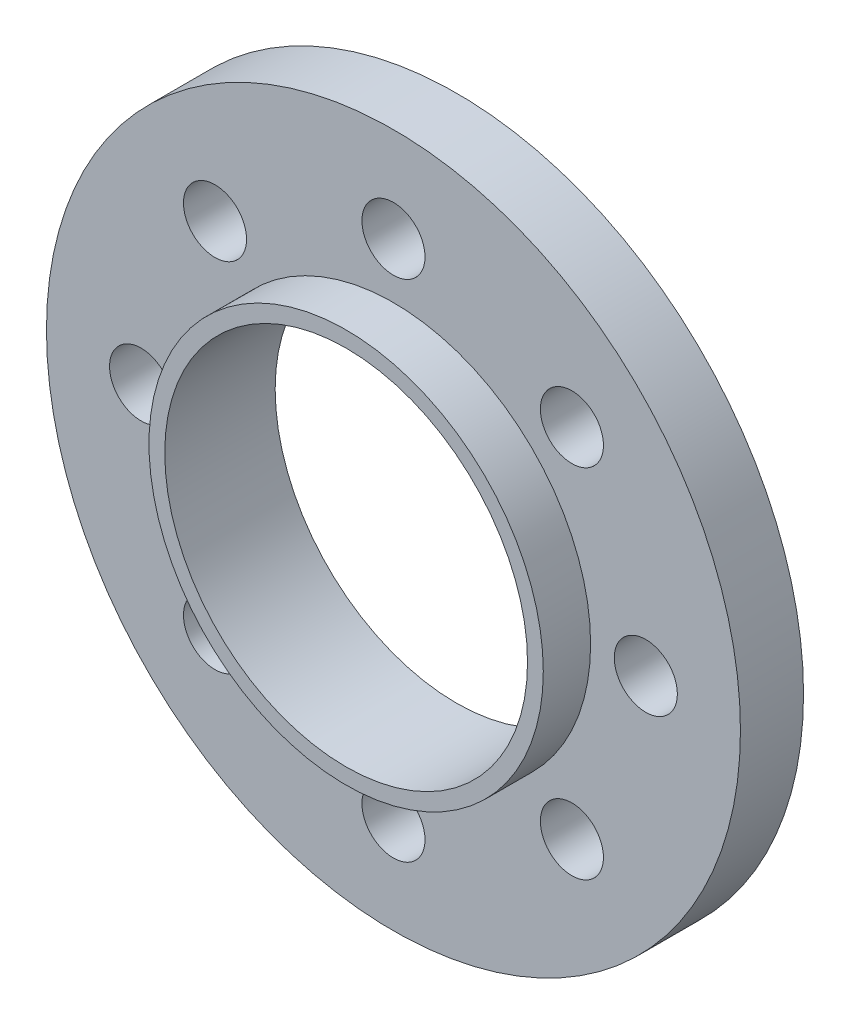
ISO-10303-21;
HEADER;
FILE_DESCRIPTION(('STEP AP214'),'2;1');
FILE_NAME('part.step','',(''),(''),'','','');
FILE_SCHEMA(('AUTOMOTIVE_DESIGN { 1 0 10303 214 1 1 1 1 }'));
ENDSEC;
DATA;
#1=APPLICATION_CONTEXT('core data for automotive mechanical design processes');
#2=APPLICATION_PROTOCOL_DEFINITION('international standard','automotive_design',2000,#1);
#3=PRODUCT_CONTEXT('',#1,'mechanical');
#4=PRODUCT('Part','Part','',(#3));
#5=PRODUCT_RELATED_PRODUCT_CATEGORY('part','',(#4));
#6=PRODUCT_DEFINITION_FORMATION('','',#4);
#7=PRODUCT_DEFINITION_CONTEXT('part definition',#1,'design');
#8=PRODUCT_DEFINITION('design','',#6,#7);
#9=PRODUCT_DEFINITION_SHAPE('','',#8);
#10=(LENGTH_UNIT() NAMED_UNIT(*) SI_UNIT(.MILLI.,.METRE.));
#11=(NAMED_UNIT(*) PLANE_ANGLE_UNIT() SI_UNIT($,.RADIAN.));
#12=(NAMED_UNIT(*) SI_UNIT($,.STERADIAN.) SOLID_ANGLE_UNIT());
#13=UNCERTAINTY_MEASURE_WITH_UNIT(LENGTH_MEASURE(1.E-05),#10,'distance_accuracy_value','');
#14=(GEOMETRIC_REPRESENTATION_CONTEXT(3) GLOBAL_UNCERTAINTY_ASSIGNED_CONTEXT((#13)) GLOBAL_UNIT_ASSIGNED_CONTEXT((#10,
#11,#12)) REPRESENTATION_CONTEXT('',''));
#15=CARTESIAN_POINT('',(0.,0.,0.));
#16=DIRECTION('',(0.,0.,1.));
#17=DIRECTION('',(1.,0.,0.));
#18=AXIS2_PLACEMENT_3D('',#15,#16,#17);
#19=CARTESIAN_POINT('',(0.,0.,2.));
#20=DIRECTION('',(0.,0.,1.));
#21=DIRECTION('',(1.,0.,0.));
#22=AXIS2_PLACEMENT_3D('',#19,#20,#21);
#23=PLANE('',#22);
#24=CARTESIAN_POINT('',(0.,0.,2.));
#25=DIRECTION('',(0.,0.,1.));
#26=DIRECTION('',(1.,0.,0.));
#27=AXIS2_PLACEMENT_3D('',#24,#25,#26);
#28=CIRCLE('',#27,6.25);
#29=CARTESIAN_POINT('',(6.25,0.,2.));
#30=VERTEX_POINT('',#29);
#31=EDGE_CURVE('E92',#30,#30,#28,.T.);
#32=ORIENTED_EDGE('',*,*,#31,.F.);
#33=EDGE_LOOP('',(#32));
#34=FACE_BOUND('',#33,.T.);
#35=CARTESIAN_POINT('',(-7.99999999999932,-6.81631167610037E-13,2.));
#36=DIRECTION('',(0.,0.,1.));
#37=DIRECTION('',(1.,0.,0.));
#38=AXIS2_PLACEMENT_3D('',#35,#36,#37);
#39=CIRCLE('',#38,1.00000000000093);
#40=CARTESIAN_POINT('',(-6.99999999999839,-6.81631167610037E-13,2.));
#41=VERTEX_POINT('',#40);
#42=EDGE_CURVE('E77',#41,#41,#39,.T.);
#43=ORIENTED_EDGE('',*,*,#42,.F.);
#44=EDGE_LOOP('',(#43));
#45=FACE_BOUND('',#44,.T.);
#46=CARTESIAN_POINT('',(1.36130290034144E-12,-8.,2.));
#47=DIRECTION('',(0.,0.,1.));
#48=DIRECTION('',(1.,0.,0.));
#49=AXIS2_PLACEMENT_3D('',#46,#47,#48);
#50=CIRCLE('',#49,1.00000000000136);
#51=CARTESIAN_POINT('',(1.00000000000272,-8.,2.));
#52=VERTEX_POINT('',#51);
#53=EDGE_CURVE('E65',#52,#52,#50,.T.);
#54=ORIENTED_EDGE('',*,*,#53,.F.);
#55=EDGE_LOOP('',(#54));
#56=FACE_BOUND('',#55,.T.);
#57=CARTESIAN_POINT('',(8.00000000000068,6.80651450170719E-13,2.));
#58=DIRECTION('',(0.,0.,1.));
#59=DIRECTION('',(1.,0.,0.));
#60=AXIS2_PLACEMENT_3D('',#57,#58,#59);
#61=CIRCLE('',#60,1.00000000000048);
#62=CARTESIAN_POINT('',(9.00000000000116,6.80651450170719E-13,2.));
#63=VERTEX_POINT('',#62);
#64=EDGE_CURVE('E53',#63,#63,#61,.T.);
#65=ORIENTED_EDGE('',*,*,#64,.F.);
#66=EDGE_LOOP('',(#65));
#67=FACE_BOUND('',#66,.T.);
#68=CARTESIAN_POINT('',(0.,8.,2.));
#69=DIRECTION('',(0.,0.,1.));
#70=DIRECTION('',(1.,0.,0.));
#71=AXIS2_PLACEMENT_3D('',#68,#69,#70);
#72=CIRCLE('',#71,1.);
#73=CARTESIAN_POINT('',(1.,8.,2.));
#74=VERTEX_POINT('',#73);
#75=EDGE_CURVE('E42',#74,#74,#72,.T.);
#76=ORIENTED_EDGE('',*,*,#75,.F.);
#77=EDGE_LOOP('',(#76));
#78=FACE_BOUND('',#77,.T.);
#79=CARTESIAN_POINT('',(0.,0.,2.));
#80=DIRECTION('',(0.,0.,1.));
#81=DIRECTION('',(1.,0.,0.));
#82=AXIS2_PLACEMENT_3D('',#79,#80,#81);
#83=CIRCLE('',#82,11.);
#84=CARTESIAN_POINT('',(11.,0.,2.));
#85=VERTEX_POINT('',#84);
#86=EDGE_CURVE('E10',#85,#85,#83,.T.);
#87=ORIENTED_EDGE('',*,*,#86,.T.);
#88=EDGE_LOOP('',(#87));
#89=FACE_BOUND('',#88,.T.);
#90=CARTESIAN_POINT('',(5.65685424949258,5.65685424949286,2.));
#91=DIRECTION('',(0.,0.,1.));
#92=DIRECTION('',(1.,0.,0.));
#93=AXIS2_PLACEMENT_3D('',#90,#91,#92);
#94=CIRCLE('',#93,1.00000000000006);
#95=CARTESIAN_POINT('',(6.65685424949264,5.65685424949286,2.));
#96=VERTEX_POINT('',#95);
#97=EDGE_CURVE('E47',#96,#96,#94,.T.);
#98=ORIENTED_EDGE('',*,*,#97,.F.);
#99=EDGE_LOOP('',(#98));
#100=FACE_BOUND('',#99,.T.);
#101=CARTESIAN_POINT('',(5.65685424949354,-5.6568542494919,2.));
#102=DIRECTION('',(0.,0.,1.));
#103=DIRECTION('',(1.,0.,0.));
#104=AXIS2_PLACEMENT_3D('',#101,#102,#103);
#105=CIRCLE('',#104,1.00000000000101);
#106=CARTESIAN_POINT('',(6.65685424949455,-5.6568542494919,2.));
#107=VERTEX_POINT('',#106);
#108=EDGE_CURVE('E59',#107,#107,#105,.T.);
#109=ORIENTED_EDGE('',*,*,#108,.F.);
#110=EDGE_LOOP('',(#109));
#111=FACE_BOUND('',#110,.T.);
#112=CARTESIAN_POINT('',(-5.65685424949122,-5.65685424949286,2.));
#113=DIRECTION('',(0.,0.,1.));
#114=DIRECTION('',(1.,0.,0.));
#115=AXIS2_PLACEMENT_3D('',#112,#113,#114);
#116=CIRCLE('',#115,1.00000000000132);
#117=CARTESIAN_POINT('',(-4.6568542494899,-5.65685424949286,2.));
#118=VERTEX_POINT('',#117);
#119=EDGE_CURVE('E71',#118,#118,#116,.T.);
#120=ORIENTED_EDGE('',*,*,#119,.F.);
#121=EDGE_LOOP('',(#120));
#122=FACE_BOUND('',#121,.T.);
#123=CARTESIAN_POINT('',(-5.65685424949218,5.6568542494919,2.));
#124=DIRECTION('',(0.,0.,1.));
#125=DIRECTION('',(1.,0.,0.));
#126=AXIS2_PLACEMENT_3D('',#123,#124,#125);
#127=CIRCLE('',#126,1.00000000000043);
#128=CARTESIAN_POINT('',(-4.65685424949176,5.6568542494919,2.));
#129=VERTEX_POINT('',#128);
#130=EDGE_CURVE('E83',#129,#129,#127,.T.);
#131=ORIENTED_EDGE('',*,*,#130,.F.);
#132=EDGE_LOOP('',(#131));
#133=FACE_BOUND('',#132,.T.);
#134=ADVANCED_FACE('F31',(#34,#45,#56,#67,#78,#89,#100,#111,#122,#133),#23,.T.);
#135=CARTESIAN_POINT('',(0.,0.,0.));
#136=DIRECTION('',(0.,0.,1.));
#137=DIRECTION('',(1.,0.,0.));
#138=AXIS2_PLACEMENT_3D('',#135,#136,#137);
#139=PLANE('',#138);
#140=CARTESIAN_POINT('',(0.,0.,0.));
#141=DIRECTION('',(0.,0.,1.));
#142=DIRECTION('',(1.,0.,0.));
#143=AXIS2_PLACEMENT_3D('',#140,#141,#142);
#144=CIRCLE('',#143,5.75);
#145=CARTESIAN_POINT('',(5.75,0.,0.));
#146=VERTEX_POINT('',#145);
#147=EDGE_CURVE('E95',#146,#146,#144,.T.);
#148=ORIENTED_EDGE('',*,*,#147,.T.);
#149=EDGE_LOOP('',(#148));
#150=FACE_BOUND('',#149,.T.);
#151=CARTESIAN_POINT('',(0.,0.,0.));
#152=DIRECTION('',(0.,0.,1.));
#153=DIRECTION('',(1.,0.,0.));
#154=AXIS2_PLACEMENT_3D('',#151,#152,#153);
#155=CIRCLE('',#154,11.);
#156=CARTESIAN_POINT('',(11.,0.,0.));
#157=VERTEX_POINT('',#156);
#158=EDGE_CURVE('E35',#157,#157,#155,.T.);
#159=ORIENTED_EDGE('',*,*,#158,.F.);
#160=EDGE_LOOP('',(#159));
#161=FACE_BOUND('',#160,.T.);
#162=CARTESIAN_POINT('',(0.,8.,0.));
#163=DIRECTION('',(0.,0.,1.));
#164=DIRECTION('',(1.,0.,0.));
#165=AXIS2_PLACEMENT_3D('',#162,#163,#164);
#166=CIRCLE('',#165,1.);
#167=CARTESIAN_POINT('',(1.,8.,0.));
#168=VERTEX_POINT('',#167);
#169=EDGE_CURVE('E44',#168,#168,#166,.T.);
#170=ORIENTED_EDGE('',*,*,#169,.T.);
#171=EDGE_LOOP('',(#170));
#172=FACE_BOUND('',#171,.T.);
#173=CARTESIAN_POINT('',(5.65685424949258,5.65685424949286,0.));
#174=DIRECTION('',(0.,0.,1.));
#175=DIRECTION('',(1.,0.,0.));
#176=AXIS2_PLACEMENT_3D('',#173,#174,#175);
#177=CIRCLE('',#176,1.00000000000006);
#178=CARTESIAN_POINT('',(6.65685424949264,5.65685424949286,0.));
#179=VERTEX_POINT('',#178);
#180=EDGE_CURVE('E50',#179,#179,#177,.T.);
#181=ORIENTED_EDGE('',*,*,#180,.T.);
#182=EDGE_LOOP('',(#181));
#183=FACE_BOUND('',#182,.T.);
#184=CARTESIAN_POINT('',(8.00000000000068,6.80651450170719E-13,0.));
#185=DIRECTION('',(0.,0.,1.));
#186=DIRECTION('',(1.,0.,0.));
#187=AXIS2_PLACEMENT_3D('',#184,#185,#186);
#188=CIRCLE('',#187,1.00000000000048);
#189=CARTESIAN_POINT('',(9.00000000000116,6.80651450170719E-13,0.));
#190=VERTEX_POINT('',#189);
#191=EDGE_CURVE('E56',#190,#190,#188,.T.);
#192=ORIENTED_EDGE('',*,*,#191,.T.);
#193=EDGE_LOOP('',(#192));
#194=FACE_BOUND('',#193,.T.);
#195=CARTESIAN_POINT('',(5.65685424949354,-5.6568542494919,0.));
#196=DIRECTION('',(0.,0.,1.));
#197=DIRECTION('',(1.,0.,0.));
#198=AXIS2_PLACEMENT_3D('',#195,#196,#197);
#199=CIRCLE('',#198,1.00000000000101);
#200=CARTESIAN_POINT('',(6.65685424949455,-5.6568542494919,0.));
#201=VERTEX_POINT('',#200);
#202=EDGE_CURVE('E62',#201,#201,#199,.T.);
#203=ORIENTED_EDGE('',*,*,#202,.T.);
#204=EDGE_LOOP('',(#203));
#205=FACE_BOUND('',#204,.T.);
#206=CARTESIAN_POINT('',(1.36130290034144E-12,-8.,0.));
#207=DIRECTION('',(0.,0.,1.));
#208=DIRECTION('',(1.,0.,0.));
#209=AXIS2_PLACEMENT_3D('',#206,#207,#208);
#210=CIRCLE('',#209,1.00000000000136);
#211=CARTESIAN_POINT('',(1.00000000000272,-8.,0.));
#212=VERTEX_POINT('',#211);
#213=EDGE_CURVE('E68',#212,#212,#210,.T.);
#214=ORIENTED_EDGE('',*,*,#213,.T.);
#215=EDGE_LOOP('',(#214));
#216=FACE_BOUND('',#215,.T.);
#217=CARTESIAN_POINT('',(-5.65685424949122,-5.65685424949286,0.));
#218=DIRECTION('',(0.,0.,1.));
#219=DIRECTION('',(1.,0.,0.));
#220=AXIS2_PLACEMENT_3D('',#217,#218,#219);
#221=CIRCLE('',#220,1.00000000000132);
#222=CARTESIAN_POINT('',(-4.6568542494899,-5.65685424949286,0.));
#223=VERTEX_POINT('',#222);
#224=EDGE_CURVE('E74',#223,#223,#221,.T.);
#225=ORIENTED_EDGE('',*,*,#224,.T.);
#226=EDGE_LOOP('',(#225));
#227=FACE_BOUND('',#226,.T.);
#228=CARTESIAN_POINT('',(-7.99999999999932,-6.81631167610037E-13,0.));
#229=DIRECTION('',(0.,0.,1.));
#230=DIRECTION('',(1.,0.,0.));
#231=AXIS2_PLACEMENT_3D('',#228,#229,#230);
#232=CIRCLE('',#231,1.00000000000093);
#233=CARTESIAN_POINT('',(-6.99999999999839,-6.81631167610037E-13,0.));
#234=VERTEX_POINT('',#233);
#235=EDGE_CURVE('E80',#234,#234,#232,.T.);
#236=ORIENTED_EDGE('',*,*,#235,.T.);
#237=EDGE_LOOP('',(#236));
#238=FACE_BOUND('',#237,.T.);
#239=CARTESIAN_POINT('',(-5.65685424949218,5.6568542494919,0.));
#240=DIRECTION('',(0.,0.,1.));
#241=DIRECTION('',(1.,0.,0.));
#242=AXIS2_PLACEMENT_3D('',#239,#240,#241);
#243=CIRCLE('',#242,1.00000000000043);
#244=CARTESIAN_POINT('',(-4.65685424949176,5.6568542494919,0.));
#245=VERTEX_POINT('',#244);
#246=EDGE_CURVE('E86',#245,#245,#243,.T.);
#247=ORIENTED_EDGE('',*,*,#246,.T.);
#248=EDGE_LOOP('',(#247));
#249=FACE_BOUND('',#248,.T.);
#250=ADVANCED_FACE('F122',(#150,#161,#172,#183,#194,#205,#216,#227,#238,#249),#139,.F.);
#251=CARTESIAN_POINT('',(0.,0.,2.));
#252=DIRECTION('',(0.,0.,-1.));
#253=DIRECTION('',(-1.,0.,0.));
#254=AXIS2_PLACEMENT_3D('',#251,#252,#253);
#255=CYLINDRICAL_SURFACE('',#254,11.);
#256=ORIENTED_EDGE('',*,*,#86,.F.);
#257=EDGE_LOOP('',(#256));
#258=FACE_BOUND('',#257,.T.);
#259=ORIENTED_EDGE('',*,*,#158,.T.);
#260=EDGE_LOOP('',(#259));
#261=FACE_BOUND('',#260,.T.);
#262=ADVANCED_FACE('F33',(#258,#261),#255,.T.);
#263=CARTESIAN_POINT('',(0.,8.,2.));
#264=DIRECTION('',(0.,0.,-1.));
#265=DIRECTION('',(-1.,0.,0.));
#266=AXIS2_PLACEMENT_3D('',#263,#264,#265);
#267=CYLINDRICAL_SURFACE('',#266,1.);
#268=ORIENTED_EDGE('',*,*,#75,.T.);
#269=EDGE_LOOP('',(#268));
#270=FACE_BOUND('',#269,.T.);
#271=ORIENTED_EDGE('',*,*,#169,.F.);
#272=EDGE_LOOP('',(#271));
#273=FACE_BOUND('',#272,.T.);
#274=ADVANCED_FACE('F151',(#270,#273),#267,.F.);
#275=CARTESIAN_POINT('',(5.65685424949258,5.65685424949286,2.));
#276=DIRECTION('',(0.,0.,-1.));
#277=DIRECTION('',(-1.,0.,0.));
#278=AXIS2_PLACEMENT_3D('',#275,#276,#277);
#279=CYLINDRICAL_SURFACE('',#278,1.00000000000006);
#280=ORIENTED_EDGE('',*,*,#97,.T.);
#281=EDGE_LOOP('',(#280));
#282=FACE_BOUND('',#281,.T.);
#283=ORIENTED_EDGE('',*,*,#180,.F.);
#284=EDGE_LOOP('',(#283));
#285=FACE_BOUND('',#284,.T.);
#286=ADVANCED_FACE('F157',(#282,#285),#279,.F.);
#287=CARTESIAN_POINT('',(8.00000000000068,6.80651450170719E-13,2.));
#288=DIRECTION('',(0.,0.,-1.));
#289=DIRECTION('',(-1.,0.,0.));
#290=AXIS2_PLACEMENT_3D('',#287,#288,#289);
#291=CYLINDRICAL_SURFACE('',#290,1.00000000000048);
#292=ORIENTED_EDGE('',*,*,#64,.T.);
#293=EDGE_LOOP('',(#292));
#294=FACE_BOUND('',#293,.T.);
#295=ORIENTED_EDGE('',*,*,#191,.F.);
#296=EDGE_LOOP('',(#295));
#297=FACE_BOUND('',#296,.T.);
#298=ADVANCED_FACE('F161',(#294,#297),#291,.F.);
#299=CARTESIAN_POINT('',(5.65685424949354,-5.6568542494919,2.));
#300=DIRECTION('',(0.,0.,-1.));
#301=DIRECTION('',(-1.,0.,0.));
#302=AXIS2_PLACEMENT_3D('',#299,#300,#301);
#303=CYLINDRICAL_SURFACE('',#302,1.00000000000101);
#304=ORIENTED_EDGE('',*,*,#108,.T.);
#305=EDGE_LOOP('',(#304));
#306=FACE_BOUND('',#305,.T.);
#307=ORIENTED_EDGE('',*,*,#202,.F.);
#308=EDGE_LOOP('',(#307));
#309=FACE_BOUND('',#308,.T.);
#310=ADVANCED_FACE('F165',(#306,#309),#303,.F.);
#311=CARTESIAN_POINT('',(1.36130290034144E-12,-8.,2.));
#312=DIRECTION('',(0.,0.,-1.));
#313=DIRECTION('',(-1.,0.,0.));
#314=AXIS2_PLACEMENT_3D('',#311,#312,#313);
#315=CYLINDRICAL_SURFACE('',#314,1.00000000000136);
#316=ORIENTED_EDGE('',*,*,#53,.T.);
#317=EDGE_LOOP('',(#316));
#318=FACE_BOUND('',#317,.T.);
#319=ORIENTED_EDGE('',*,*,#213,.F.);
#320=EDGE_LOOP('',(#319));
#321=FACE_BOUND('',#320,.T.);
#322=ADVANCED_FACE('F169',(#318,#321),#315,.F.);
#323=CARTESIAN_POINT('',(-5.65685424949122,-5.65685424949286,2.));
#324=DIRECTION('',(0.,0.,-1.));
#325=DIRECTION('',(-1.,0.,0.));
#326=AXIS2_PLACEMENT_3D('',#323,#324,#325);
#327=CYLINDRICAL_SURFACE('',#326,1.00000000000132);
#328=ORIENTED_EDGE('',*,*,#119,.T.);
#329=EDGE_LOOP('',(#328));
#330=FACE_BOUND('',#329,.T.);
#331=ORIENTED_EDGE('',*,*,#224,.F.);
#332=EDGE_LOOP('',(#331));
#333=FACE_BOUND('',#332,.T.);
#334=ADVANCED_FACE('F173',(#330,#333),#327,.F.);
#335=CARTESIAN_POINT('',(-7.99999999999932,-6.81631167610037E-13,2.));
#336=DIRECTION('',(0.,0.,-1.));
#337=DIRECTION('',(-1.,0.,0.));
#338=AXIS2_PLACEMENT_3D('',#335,#336,#337);
#339=CYLINDRICAL_SURFACE('',#338,1.00000000000093);
#340=ORIENTED_EDGE('',*,*,#42,.T.);
#341=EDGE_LOOP('',(#340));
#342=FACE_BOUND('',#341,.T.);
#343=ORIENTED_EDGE('',*,*,#235,.F.);
#344=EDGE_LOOP('',(#343));
#345=FACE_BOUND('',#344,.T.);
#346=ADVANCED_FACE('F142',(#342,#345),#339,.F.);
#347=CARTESIAN_POINT('',(-5.65685424949218,5.6568542494919,2.));
#348=DIRECTION('',(0.,0.,-1.));
#349=DIRECTION('',(-1.,0.,0.));
#350=AXIS2_PLACEMENT_3D('',#347,#348,#349);
#351=CYLINDRICAL_SURFACE('',#350,1.00000000000043);
#352=ORIENTED_EDGE('',*,*,#130,.T.);
#353=EDGE_LOOP('',(#352));
#354=FACE_BOUND('',#353,.T.);
#355=ORIENTED_EDGE('',*,*,#246,.F.);
#356=EDGE_LOOP('',(#355));
#357=FACE_BOUND('',#356,.T.);
#358=ADVANCED_FACE('F116',(#354,#357),#351,.F.);
#359=CARTESIAN_POINT('',(0.,0.,3.5));
#360=DIRECTION('',(0.,0.,-1.));
#361=DIRECTION('',(-1.,0.,0.));
#362=AXIS2_PLACEMENT_3D('',#359,#360,#361);
#363=CYLINDRICAL_SURFACE('',#362,6.25);
#364=CARTESIAN_POINT('',(0.,0.,3.5));
#365=DIRECTION('',(0.,0.,1.));
#366=DIRECTION('',(1.,0.,0.));
#367=AXIS2_PLACEMENT_3D('',#364,#365,#366);
#368=CIRCLE('',#367,6.25);
#369=CARTESIAN_POINT('',(6.25,0.,3.5));
#370=VERTEX_POINT('',#369);
#371=EDGE_CURVE('E89',#370,#370,#368,.T.);
#372=ORIENTED_EDGE('',*,*,#371,.F.);
#373=EDGE_LOOP('',(#372));
#374=FACE_BOUND('',#373,.T.);
#375=ORIENTED_EDGE('',*,*,#31,.T.);
#376=EDGE_LOOP('',(#375));
#377=FACE_BOUND('',#376,.T.);
#378=ADVANCED_FACE('F110',(#374,#377),#363,.T.);
#379=CARTESIAN_POINT('',(0.,0.,3.5));
#380=DIRECTION('',(0.,0.,1.));
#381=DIRECTION('',(1.,0.,0.));
#382=AXIS2_PLACEMENT_3D('',#379,#380,#381);
#383=PLANE('',#382);
#384=CARTESIAN_POINT('',(0.,0.,3.5));
#385=DIRECTION('',(0.,0.,1.));
#386=DIRECTION('',(1.,0.,0.));
#387=AXIS2_PLACEMENT_3D('',#384,#385,#386);
#388=CIRCLE('',#387,5.75);
#389=CARTESIAN_POINT('',(5.75,0.,3.5));
#390=VERTEX_POINT('',#389);
#391=EDGE_CURVE('E100',#390,#390,#388,.T.);
#392=ORIENTED_EDGE('',*,*,#391,.F.);
#393=EDGE_LOOP('',(#392));
#394=FACE_BOUND('',#393,.T.);
#395=ORIENTED_EDGE('',*,*,#371,.T.);
#396=EDGE_LOOP('',(#395));
#397=FACE_BOUND('',#396,.T.);
#398=ADVANCED_FACE('F107',(#394,#397),#383,.T.);
#399=CARTESIAN_POINT('',(0.,0.,-7.5));
#400=DIRECTION('',(0.,0.,1.));
#401=DIRECTION('',(1.,0.,0.));
#402=AXIS2_PLACEMENT_3D('',#399,#400,#401);
#403=CYLINDRICAL_SURFACE('',#402,5.75);
#404=ORIENTED_EDGE('',*,*,#391,.T.);
#405=EDGE_LOOP('',(#404));
#406=FACE_BOUND('',#405,.T.);
#407=ORIENTED_EDGE('',*,*,#147,.F.);
#408=EDGE_LOOP('',(#407));
#409=FACE_BOUND('',#408,.T.);
#410=ADVANCED_FACE('F104',(#406,#409),#403,.F.);
#411=CLOSED_SHELL('',(#134,#250,#262,#274,#286,#298,#310,#322,#334,#346,#358,#378,#398,#410));
#412=MANIFOLD_SOLID_BREP('B2',#411);
#413=ADVANCED_BREP_SHAPE_REPRESENTATION('',(#18,#412),#14);
#414=SHAPE_DEFINITION_REPRESENTATION(#9,#413);
ENDSEC;
END-ISO-10303-21;
